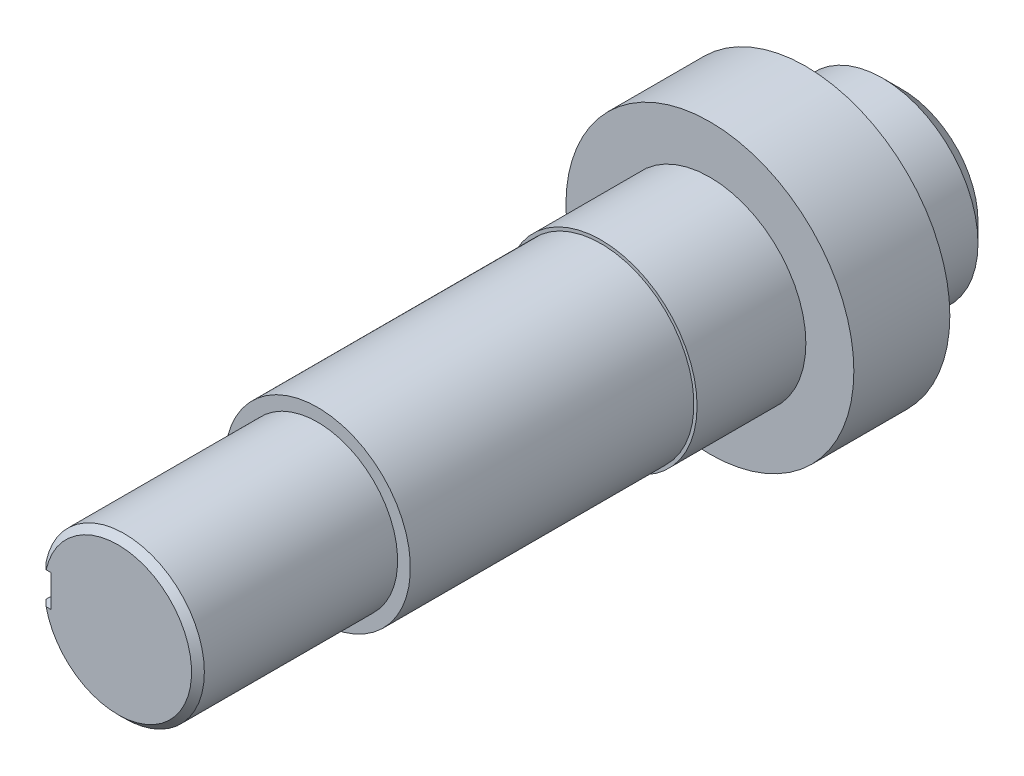
ISO-10303-21;
HEADER;
FILE_DESCRIPTION(('STEP AP214'),'2;1');
FILE_NAME('part.step','',(''),(''),'','','');
FILE_SCHEMA(('AUTOMOTIVE_DESIGN { 1 0 10303 214 1 1 1 1 }'));
ENDSEC;
DATA;
#1=APPLICATION_CONTEXT('core data for automotive mechanical design processes');
#2=APPLICATION_PROTOCOL_DEFINITION('international standard','automotive_design',2000,#1);
#3=PRODUCT_CONTEXT('',#1,'mechanical');
#4=PRODUCT('Part','Part','',(#3));
#5=PRODUCT_RELATED_PRODUCT_CATEGORY('part','',(#4));
#6=PRODUCT_DEFINITION_FORMATION('','',#4);
#7=PRODUCT_DEFINITION_CONTEXT('part definition',#1,'design');
#8=PRODUCT_DEFINITION('design','',#6,#7);
#9=PRODUCT_DEFINITION_SHAPE('','',#8);
#10=(LENGTH_UNIT() NAMED_UNIT(*) SI_UNIT(.MILLI.,.METRE.));
#11=(NAMED_UNIT(*) PLANE_ANGLE_UNIT() SI_UNIT($,.RADIAN.));
#12=(NAMED_UNIT(*) SI_UNIT($,.STERADIAN.) SOLID_ANGLE_UNIT());
#13=UNCERTAINTY_MEASURE_WITH_UNIT(LENGTH_MEASURE(1.E-05),#10,'distance_accuracy_value','');
#14=(GEOMETRIC_REPRESENTATION_CONTEXT(3) GLOBAL_UNCERTAINTY_ASSIGNED_CONTEXT((#13)) GLOBAL_UNIT_ASSIGNED_CONTEXT((#10,
#11,#12)) REPRESENTATION_CONTEXT('',''));
#15=CARTESIAN_POINT('',(0.,0.,0.));
#16=DIRECTION('',(0.,0.,1.));
#17=DIRECTION('',(1.,0.,0.));
#18=AXIS2_PLACEMENT_3D('',#15,#16,#17);
#19=CARTESIAN_POINT('',(0.,0.,-7.49999999999999));
#20=DIRECTION('',(0.,0.,-1.));
#21=DIRECTION('',(-1.,0.,0.));
#22=AXIS2_PLACEMENT_3D('',#19,#20,#21);
#23=CYLINDRICAL_SURFACE('',#22,12.5);
#24=CARTESIAN_POINT('',(0.,0.,83.8));
#25=DIRECTION('',(0.,0.,-1.));
#26=DIRECTION('',(-1.,0.,0.));
#27=AXIS2_PLACEMENT_3D('',#24,#25,#26);
#28=CIRCLE('',#27,12.5);
#29=CARTESIAN_POINT('',(-12.5,0.,83.8));
#30=VERTEX_POINT('',#29);
#31=EDGE_CURVE('E133',#30,#30,#28,.T.);
#32=ORIENTED_EDGE('',*,*,#31,.F.);
#33=EDGE_LOOP('',(#32));
#34=FACE_BOUND('',#33,.T.);
#35=DIRECTION('',(0.,0.,-1.));
#36=VECTOR('',#35,1.);
#37=CARTESIAN_POINT('',(-12.2474487139159,2.5,-7.49999999999999));
#38=LINE('',#37,#36);
#39=CARTESIAN_POINT('',(-12.2474487139159,2.49999999999997,114.));
#40=VERTEX_POINT('',#39);
#41=CARTESIAN_POINT('',(-12.2474487139159,2.49999999999997,102.));
#42=VERTEX_POINT('',#41);
#43=EDGE_CURVE('E100',#40,#42,#38,.T.);
#44=ORIENTED_EDGE('',*,*,#43,.F.);
#45=CARTESIAN_POINT('',(0.,0.,114.));
#46=DIRECTION('',(0.,0.,-1.));
#47=DIRECTION('',(-1.,0.,0.));
#48=AXIS2_PLACEMENT_3D('',#45,#46,#47);
#49=CIRCLE('',#48,12.5);
#50=CARTESIAN_POINT('',(-12.2474487139159,-2.50000000000003,114.));
#51=VERTEX_POINT('',#50);
#52=EDGE_CURVE('E190',#40,#51,#49,.T.);
#53=ORIENTED_EDGE('',*,*,#52,.T.);
#54=DIRECTION('',(0.,0.,-1.));
#55=VECTOR('',#54,1.);
#56=CARTESIAN_POINT('',(-12.2474487139159,-2.5,-7.49999999999999));
#57=LINE('',#56,#55);
#58=CARTESIAN_POINT('',(-12.2474487139159,-2.50000000000003,102.));
#59=VERTEX_POINT('',#58);
#60=EDGE_CURVE('E105',#59,#51,#57,.F.);
#61=ORIENTED_EDGE('',*,*,#60,.F.);
#62=CARTESIAN_POINT('',(-12.2474487139159,2.49999999999997,102.));
#63=CARTESIAN_POINT('',(-12.2474426870481,2.50000755272739,101.930435992851));
#64=CARTESIAN_POINT('',(-12.2480412546813,2.49709659553058,101.860876158115));
#65=CARTESIAN_POINT('',(-12.2504029528616,2.48549624534852,101.722268250026));
#66=CARTESIAN_POINT('',(-12.2521659393457,2.47680756718741,101.653220114433));
#67=CARTESIAN_POINT('',(-12.25680833904,2.45372788482213,101.516225753348));
#68=CARTESIAN_POINT('',(-12.259686051341,2.43934556755121,101.448278012586));
#69=CARTESIAN_POINT('',(-12.2664685140532,2.40500601307053,101.313877989414));
#70=CARTESIAN_POINT('',(-12.2703732686573,2.38504875310236,101.247425713109));
#71=CARTESIAN_POINT('',(-12.2834692504436,2.31701273293405,101.050995245321));
#72=CARTESIAN_POINT('',(-12.2940461363477,2.26075131705716,100.923834951703));
#73=CARTESIAN_POINT('',(-12.3176934066007,2.12812970933263,100.680810514378));
#74=CARTESIAN_POINT('',(-12.3307640493468,2.05176743436917,100.564947543155));
#75=CARTESIAN_POINT('',(-12.3581317705241,1.87995278838543,100.346107851703));
#76=CARTESIAN_POINT('',(-12.3724421926957,1.78427266064754,100.243311289598));
#77=CARTESIAN_POINT('',(-12.4005606698654,1.57702607132323,100.055111906301));
#78=CARTESIAN_POINT('',(-12.4143686467546,1.46545715284147,99.9697117801072));
#79=CARTESIAN_POINT('',(-12.4400702526805,1.22840024371406,99.8180282891781));
#80=CARTESIAN_POINT('',(-12.4519461799055,1.10279959145388,99.751917721986));
#81=CARTESIAN_POINT('',(-12.4722938885067,0.842002975760135,99.6418101436303));
#82=CARTESIAN_POINT('',(-12.4807661733763,0.706808435013447,99.5978098614993));
#83=CARTESIAN_POINT('',(-12.4932579438613,0.432543529973101,99.5337324169305));
#84=CARTESIAN_POINT('',(-12.4973345628875,0.293547588516944,99.5133480364947));
#85=CARTESIAN_POINT('',(-12.5007730438039,0.0140496897959572,99.4961225412004));
#86=CARTESIAN_POINT('',(-12.5001352506414,-0.126452156532632,99.4992797038381));
#87=CARTESIAN_POINT('',(-12.494260861056,-0.402855506346854,99.5288155036062));
#88=CARTESIAN_POINT('',(-12.4890899207821,-0.538794033247064,99.5548626254795));
#89=CARTESIAN_POINT('',(-12.4748043625545,-0.804330016531288,99.6289129417226));
#90=CARTESIAN_POINT('',(-12.4656896156329,-0.933927265392467,99.6769168541128));
#91=CARTESIAN_POINT('',(-12.4444322280103,-1.18405067824293,99.7938260089324));
#92=CARTESIAN_POINT('',(-12.4322708097766,-1.30451431703061,99.862861467367));
#93=CARTESIAN_POINT('',(-12.4062612907301,-1.53226609471826,100.01977567564));
#94=CARTESIAN_POINT('',(-12.3924130501763,-1.63955314055335,100.107655987095));
#95=CARTESIAN_POINT('',(-12.3642759342124,-1.83986551634356,100.301570904077));
#96=CARTESIAN_POINT('',(-12.3499835810434,-1.93261173748934,100.407893505183));
#97=CARTESIAN_POINT('',(-12.3227926529106,-2.09902724974942,100.634761896218));
#98=CARTESIAN_POINT('',(-12.3098944646352,-2.17269125605407,100.755311612915));
#99=CARTESIAN_POINT('',(-12.286943251058,-2.29894988661174,101.007631012366));
#100=CARTESIAN_POINT('',(-12.2768979874586,-2.35148719158621,101.139430058492));
#101=CARTESIAN_POINT('',(-12.2609040265623,-2.43351774332485,101.410146578139));
#102=CARTESIAN_POINT('',(-12.2549492282072,-2.46304531871088,101.54905311662));
#103=CARTESIAN_POINT('',(-12.2500794297991,-2.48708234530495,101.740892042116));
#104=CARTESIAN_POINT('',(-12.2490939967998,-2.4919281391388,101.792635349456));
#105=CARTESIAN_POINT('',(-12.2477791846693,-2.49838291166164,101.896244660344));
#106=CARTESIAN_POINT('',(-12.2474487076206,-2.49999730726165,101.94811031239));
#107=CARTESIAN_POINT('',(-12.2474487139159,-2.50000000000003,102.));
#108=B_SPLINE_CURVE_WITH_KNOTS('',3,(#62,#63,#64,#65,#66,#67,#68,#69,#70,#71,#72,#73,#74,#75,
#76,#77,#78,#79,#80,#81,#82,#83,#84,#85,#86,#87,#88,#89,#90,#91,#92,#93,#94,#95,#96,#97,#98,#99,
#100,#101,#102,#103,#104,#105,#106,#107),.UNSPECIFIED.,.F.,.F.,(4,2,2,2,2,2,2,2,2,2,2,2,2,2,2,2,
2,2,2,2,2,2,4),(0.,0.20862127589482,0.417216745803859,0.625495175237023,0.833774454931128,
1.25000691135226,1.66628252025788,2.08778731527758,2.50935735880449,2.93459542557451,
3.35977056463057,3.77935021287093,4.19889916132037,4.61247011057756,5.02605458519858,
5.44225366753898,5.85848725240718,6.28192795775074,6.70548580970532,7.13018519486868,
7.5542497439484,7.71010621722898,7.8657012030583),.UNSPECIFIED.);
#109=EDGE_CURVE('E181',#42,#59,#108,.T.);
#110=ORIENTED_EDGE('',*,*,#109,.F.);
#111=EDGE_LOOP('',(#44,#53,#61,#110));
#112=FACE_BOUND('',#111,.T.);
#113=ADVANCED_FACE('F42',(#34,#112),#23,.T.);
#114=CARTESIAN_POINT('',(0.,12.5,115.));
#115=DIRECTION('',(0.,0.,-1.));
#116=DIRECTION('',(-1.,0.,0.));
#117=AXIS2_PLACEMENT_3D('',#114,#115,#116);
#118=PLANE('',#117);
#119=DIRECTION('',(1.,0.,0.));
#120=VECTOR('',#119,1.);
#121=CARTESIAN_POINT('',(0.,-2.50000000000003,115.));
#122=LINE('',#121,#120);
#123=CARTESIAN_POINT('',(-11.2249721603218,-2.50000000000003,115.));
#124=VERTEX_POINT('',#123);
#125=CARTESIAN_POINT('',(-10.5,-2.50000000000003,115.));
#126=VERTEX_POINT('',#125);
#127=EDGE_CURVE('E175',#124,#126,#122,.T.);
#128=ORIENTED_EDGE('',*,*,#127,.F.);
#129=CARTESIAN_POINT('',(0.,0.,115.));
#130=DIRECTION('',(0.,0.,-1.));
#131=DIRECTION('',(-1.,0.,0.));
#132=AXIS2_PLACEMENT_3D('',#129,#130,#131);
#133=CIRCLE('',#132,11.5);
#134=CARTESIAN_POINT('',(-11.2249721603218,2.49999999999997,115.));
#135=VERTEX_POINT('',#134);
#136=EDGE_CURVE('E57',#124,#135,#133,.F.);
#137=ORIENTED_EDGE('',*,*,#136,.T.);
#138=DIRECTION('',(-1.,0.,0.));
#139=VECTOR('',#138,1.);
#140=CARTESIAN_POINT('',(0.,2.49999999999997,115.));
#141=LINE('',#140,#139);
#142=CARTESIAN_POINT('',(-10.5,2.49999999999997,115.));
#143=VERTEX_POINT('',#142);
#144=EDGE_CURVE('E178',#143,#135,#141,.T.);
#145=ORIENTED_EDGE('',*,*,#144,.F.);
#146=DIRECTION('',(0.,1.,0.));
#147=VECTOR('',#146,1.);
#148=CARTESIAN_POINT('',(-10.5,12.5,115.));
#149=LINE('',#148,#147);
#150=EDGE_CURVE('E115',#126,#143,#149,.T.);
#151=ORIENTED_EDGE('',*,*,#150,.F.);
#152=EDGE_LOOP('',(#128,#137,#145,#151));
#153=FACE_BOUND('',#152,.T.);
#154=ADVANCED_FACE('F204',(#153),#118,.F.);
#155=CARTESIAN_POINT('',(0.,0.,-7.49999999999999));
#156=DIRECTION('',(0.,0.,1.));
#157=DIRECTION('',(1.,0.,0.));
#158=AXIS2_PLACEMENT_3D('',#155,#156,#157);
#159=PLANE('',#158);
#160=CARTESIAN_POINT('',(0.,0.,-7.49999999999999));
#161=DIRECTION('',(0.,0.,1.));
#162=DIRECTION('',(1.,0.,0.));
#163=AXIS2_PLACEMENT_3D('',#160,#161,#162);
#164=CIRCLE('',#163,11.9);
#165=CARTESIAN_POINT('',(11.9,0.,-7.49999999999999));
#166=VERTEX_POINT('',#165);
#167=EDGE_CURVE('E165',#166,#166,#164,.F.);
#168=ORIENTED_EDGE('',*,*,#167,.T.);
#169=EDGE_LOOP('',(#168));
#170=FACE_BOUND('',#169,.T.);
#171=ADVANCED_FACE('F206',(#170),#159,.F.);
#172=CARTESIAN_POINT('',(0.,0.,-7.49999999999999));
#173=DIRECTION('',(0.,0.,-1.));
#174=DIRECTION('',(-1.,0.,0.));
#175=AXIS2_PLACEMENT_3D('',#172,#173,#174);
#176=CYLINDRICAL_SURFACE('',#175,14.9);
#177=CARTESIAN_POINT('',(0.,0.,-4.49999999999996));
#178=DIRECTION('',(0.,0.,1.));
#179=DIRECTION('',(1.,0.,0.));
#180=AXIS2_PLACEMENT_3D('',#177,#178,#179);
#181=CIRCLE('',#180,14.9);
#182=CARTESIAN_POINT('',(14.9,0.,-4.49999999999996));
#183=VERTEX_POINT('',#182);
#184=EDGE_CURVE('E169',#183,#183,#181,.T.);
#185=ORIENTED_EDGE('',*,*,#184,.T.);
#186=EDGE_LOOP('',(#185));
#187=FACE_BOUND('',#186,.T.);
#188=CARTESIAN_POINT('',(0.,0.,7.50000000000001));
#189=DIRECTION('',(0.,0.,-1.));
#190=DIRECTION('',(-1.,0.,0.));
#191=AXIS2_PLACEMENT_3D('',#188,#189,#190);
#192=CIRCLE('',#191,14.9);
#193=CARTESIAN_POINT('',(-14.9,0.,7.50000000000001));
#194=VERTEX_POINT('',#193);
#195=EDGE_CURVE('E161',#194,#194,#192,.T.);
#196=ORIENTED_EDGE('',*,*,#195,.T.);
#197=EDGE_LOOP('',(#196));
#198=FACE_BOUND('',#197,.T.);
#199=ADVANCED_FACE('F211',(#187,#198),#176,.T.);
#200=CARTESIAN_POINT('',(0.,14.9,7.50000000000001));
#201=DIRECTION('',(0.,0.,1.));
#202=DIRECTION('',(1.,0.,0.));
#203=AXIS2_PLACEMENT_3D('',#200,#201,#202);
#204=PLANE('',#203);
#205=ORIENTED_EDGE('',*,*,#195,.F.);
#206=EDGE_LOOP('',(#205));
#207=FACE_BOUND('',#206,.T.);
#208=CARTESIAN_POINT('',(0.,0.,7.50000000000001));
#209=DIRECTION('',(0.,0.,-1.));
#210=DIRECTION('',(-1.,0.,0.));
#211=AXIS2_PLACEMENT_3D('',#208,#209,#210);
#212=CIRCLE('',#211,22.5);
#213=CARTESIAN_POINT('',(-22.5,0.,7.50000000000001));
#214=VERTEX_POINT('',#213);
#215=EDGE_CURVE('E157',#214,#214,#212,.T.);
#216=ORIENTED_EDGE('',*,*,#215,.T.);
#217=EDGE_LOOP('',(#216));
#218=FACE_BOUND('',#217,.T.);
#219=ADVANCED_FACE('F338',(#207,#218),#204,.F.);
#220=CARTESIAN_POINT('',(0.,0.,-7.49999999999999));
#221=DIRECTION('',(0.,0.,-1.));
#222=DIRECTION('',(-1.,0.,0.));
#223=AXIS2_PLACEMENT_3D('',#220,#221,#222);
#224=CYLINDRICAL_SURFACE('',#223,22.5);
#225=ORIENTED_EDGE('',*,*,#215,.F.);
#226=EDGE_LOOP('',(#225));
#227=FACE_BOUND('',#226,.T.);
#228=CARTESIAN_POINT('',(0.,0.,22.5));
#229=DIRECTION('',(0.,0.,-1.));
#230=DIRECTION('',(-1.,0.,0.));
#231=AXIS2_PLACEMENT_3D('',#228,#229,#230);
#232=CIRCLE('',#231,22.5);
#233=CARTESIAN_POINT('',(-22.5,0.,22.5));
#234=VERTEX_POINT('',#233);
#235=EDGE_CURVE('E153',#234,#234,#232,.T.);
#236=ORIENTED_EDGE('',*,*,#235,.T.);
#237=EDGE_LOOP('',(#236));
#238=FACE_BOUND('',#237,.T.);
#239=ADVANCED_FACE('F327',(#227,#238),#224,.T.);
#240=CARTESIAN_POINT('',(0.,22.5,22.5));
#241=DIRECTION('',(0.,0.,-1.));
#242=DIRECTION('',(-1.,0.,0.));
#243=AXIS2_PLACEMENT_3D('',#240,#241,#242);
#244=PLANE('',#243);
#245=ORIENTED_EDGE('',*,*,#235,.F.);
#246=EDGE_LOOP('',(#245));
#247=FACE_BOUND('',#246,.T.);
#248=CARTESIAN_POINT('',(0.,0.,22.5));
#249=DIRECTION('',(0.,0.,-1.));
#250=DIRECTION('',(-1.,0.,0.));
#251=AXIS2_PLACEMENT_3D('',#248,#249,#250);
#252=CIRCLE('',#251,15.);
#253=CARTESIAN_POINT('',(-15.,0.,22.5));
#254=VERTEX_POINT('',#253);
#255=EDGE_CURVE('E149',#254,#254,#252,.T.);
#256=ORIENTED_EDGE('',*,*,#255,.T.);
#257=EDGE_LOOP('',(#256));
#258=FACE_BOUND('',#257,.T.);
#259=ADVANCED_FACE('F316',(#247,#258),#244,.F.);
#260=CARTESIAN_POINT('',(0.,0.,-7.49999999999999));
#261=DIRECTION('',(0.,0.,-1.));
#262=DIRECTION('',(-1.,0.,0.));
#263=AXIS2_PLACEMENT_3D('',#260,#261,#262);
#264=CYLINDRICAL_SURFACE('',#263,15.);
#265=ORIENTED_EDGE('',*,*,#255,.F.);
#266=EDGE_LOOP('',(#265));
#267=FACE_BOUND('',#266,.T.);
#268=CARTESIAN_POINT('',(0.,0.,39.5));
#269=DIRECTION('',(0.,0.,-1.));
#270=DIRECTION('',(-1.,0.,0.));
#271=AXIS2_PLACEMENT_3D('',#268,#269,#270);
#272=CIRCLE('',#271,15.);
#273=CARTESIAN_POINT('',(-15.,0.,39.5));
#274=VERTEX_POINT('',#273);
#275=EDGE_CURVE('E145',#274,#274,#272,.T.);
#276=ORIENTED_EDGE('',*,*,#275,.T.);
#277=EDGE_LOOP('',(#276));
#278=FACE_BOUND('',#277,.T.);
#279=ADVANCED_FACE('F305',(#267,#278),#264,.T.);
#280=CARTESIAN_POINT('',(0.,15.,39.5));
#281=DIRECTION('',(0.,0.,-1.));
#282=DIRECTION('',(-1.,0.,0.));
#283=AXIS2_PLACEMENT_3D('',#280,#281,#282);
#284=PLANE('',#283);
#285=ORIENTED_EDGE('',*,*,#275,.F.);
#286=EDGE_LOOP('',(#285));
#287=FACE_BOUND('',#286,.T.);
#288=CARTESIAN_POINT('',(0.,0.,39.5));
#289=DIRECTION('',(0.,0.,-1.));
#290=DIRECTION('',(-1.,0.,0.));
#291=AXIS2_PLACEMENT_3D('',#288,#289,#290);
#292=CIRCLE('',#291,14.5);
#293=CARTESIAN_POINT('',(-14.5,0.,39.5));
#294=VERTEX_POINT('',#293);
#295=EDGE_CURVE('E141',#294,#294,#292,.T.);
#296=ORIENTED_EDGE('',*,*,#295,.T.);
#297=EDGE_LOOP('',(#296));
#298=FACE_BOUND('',#297,.T.);
#299=ADVANCED_FACE('F294',(#287,#298),#284,.F.);
#300=CARTESIAN_POINT('',(0.,0.,-7.49999999999999));
#301=DIRECTION('',(0.,0.,-1.));
#302=DIRECTION('',(-1.,0.,0.));
#303=AXIS2_PLACEMENT_3D('',#300,#301,#302);
#304=CYLINDRICAL_SURFACE('',#303,14.5);
#305=ORIENTED_EDGE('',*,*,#295,.F.);
#306=EDGE_LOOP('',(#305));
#307=FACE_BOUND('',#306,.T.);
#308=CARTESIAN_POINT('',(0.,0.,83.8));
#309=DIRECTION('',(0.,0.,-1.));
#310=DIRECTION('',(-1.,0.,0.));
#311=AXIS2_PLACEMENT_3D('',#308,#309,#310);
#312=CIRCLE('',#311,14.5);
#313=CARTESIAN_POINT('',(-14.5,0.,83.8));
#314=VERTEX_POINT('',#313);
#315=EDGE_CURVE('E137',#314,#314,#312,.T.);
#316=ORIENTED_EDGE('',*,*,#315,.T.);
#317=EDGE_LOOP('',(#316));
#318=FACE_BOUND('',#317,.T.);
#319=ADVANCED_FACE('F284',(#307,#318),#304,.T.);
#320=CARTESIAN_POINT('',(0.,14.5,83.8));
#321=DIRECTION('',(0.,0.,-1.));
#322=DIRECTION('',(-1.,0.,0.));
#323=AXIS2_PLACEMENT_3D('',#320,#321,#322);
#324=PLANE('',#323);
#325=ORIENTED_EDGE('',*,*,#315,.F.);
#326=EDGE_LOOP('',(#325));
#327=FACE_BOUND('',#326,.T.);
#328=ORIENTED_EDGE('',*,*,#31,.T.);
#329=EDGE_LOOP('',(#328));
#330=FACE_BOUND('',#329,.T.);
#331=ADVANCED_FACE('F274',(#327,#330),#324,.F.);
#332=CARTESIAN_POINT('',(0.,0.,-7.49999999999999));
#333=DIRECTION('',(0.,0.,1.));
#334=DIRECTION('',(1.,0.,0.));
#335=AXIS2_PLACEMENT_3D('',#332,#333,#334);
#336=CONICAL_SURFACE('',#335,11.9,0.785398163397447);
#337=ORIENTED_EDGE('',*,*,#184,.F.);
#338=EDGE_LOOP('',(#337));
#339=FACE_BOUND('',#338,.T.);
#340=ORIENTED_EDGE('',*,*,#167,.F.);
#341=EDGE_LOOP('',(#340));
#342=FACE_BOUND('',#341,.T.);
#343=ADVANCED_FACE('F198',(#339,#342),#336,.T.);
#344=CARTESIAN_POINT('',(-22.5,0.,102.));
#345=DIRECTION('',(1.,0.,0.));
#346=DIRECTION('',(0.,0.,-1.));
#347=AXIS2_PLACEMENT_3D('',#344,#345,#346);
#348=CYLINDRICAL_SURFACE('',#347,2.5);
#349=ORIENTED_EDGE('',*,*,#109,.T.);
#350=DIRECTION('',(1.,0.,0.));
#351=VECTOR('',#350,1.);
#352=CARTESIAN_POINT('',(-22.5,-2.50000000000002,102.));
#353=LINE('',#352,#351);
#354=CARTESIAN_POINT('',(-10.5,-2.50000000000003,102.));
#355=VERTEX_POINT('',#354);
#356=EDGE_CURVE('E106',#59,#355,#353,.T.);
#357=ORIENTED_EDGE('',*,*,#356,.T.);
#358=CARTESIAN_POINT('',(-10.5,0.,102.));
#359=DIRECTION('',(-1.,0.,0.));
#360=DIRECTION('',(0.,0.,1.));
#361=AXIS2_PLACEMENT_3D('',#358,#359,#360);
#362=CIRCLE('',#361,2.5);
#363=CARTESIAN_POINT('',(-10.5,2.49999999999997,102.));
#364=VERTEX_POINT('',#363);
#365=EDGE_CURVE('E112',#364,#355,#362,.T.);
#366=ORIENTED_EDGE('',*,*,#365,.F.);
#367=DIRECTION('',(1.,0.,0.));
#368=VECTOR('',#367,1.);
#369=CARTESIAN_POINT('',(-22.5,2.49999999999999,102.));
#370=LINE('',#369,#368);
#371=EDGE_CURVE('E95',#42,#364,#370,.T.);
#372=ORIENTED_EDGE('',*,*,#371,.F.);
#373=EDGE_LOOP('',(#349,#357,#366,#372));
#374=FACE_BOUND('',#373,.T.);
#375=ADVANCED_FACE('F118',(#374),#348,.F.);
#376=CARTESIAN_POINT('',(-22.5,2.49999999999999,128.));
#377=DIRECTION('',(0.,-1.,0.));
#378=DIRECTION('',(1.,0.,0.));
#379=AXIS2_PLACEMENT_3D('',#376,#377,#378);
#380=PLANE('',#379);
#381=ORIENTED_EDGE('',*,*,#144,.T.);
#382=CARTESIAN_POINT('',(-11.2249721603218,2.49999999999997,115.));
#383=CARTESIAN_POINT('',(-11.3955427232605,2.49999999999998,114.833494681046));
#384=CARTESIAN_POINT('',(-11.5660343849909,2.49999999999999,114.666908687457));
#385=CARTESIAN_POINT('',(-11.9068599028527,2.49999999999999,114.333575354121));
#386=CARTESIAN_POINT('',(-12.0771937589869,2.49999999999998,114.166828014377));
#387=CARTESIAN_POINT('',(-12.2474487139159,2.49999999999997,114.));
#388=B_SPLINE_CURVE_WITH_KNOTS('',3,(#382,#383,#384,#385,#386,#387),.UNSPECIFIED.,.F.,.F.,(4,2,
4),(0.,0.715097685506868,1.4301953576579),.UNSPECIFIED.);
#389=EDGE_CURVE('E11',#135,#40,#388,.T.);
#390=ORIENTED_EDGE('',*,*,#389,.T.);
#391=ORIENTED_EDGE('',*,*,#43,.T.);
#392=ORIENTED_EDGE('',*,*,#371,.T.);
#393=DIRECTION('',(0.,0.,-1.));
#394=VECTOR('',#393,1.);
#395=CARTESIAN_POINT('',(-10.5,2.49999999999997,128.));
#396=LINE('',#395,#394);
#397=EDGE_CURVE('E98',#143,#364,#396,.T.);
#398=ORIENTED_EDGE('',*,*,#397,.F.);
#399=EDGE_LOOP('',(#381,#390,#391,#392,#398));
#400=FACE_BOUND('',#399,.T.);
#401=ADVANCED_FACE('F97',(#400),#380,.T.);
#402=CARTESIAN_POINT('',(-22.5,-2.50000000000002,128.));
#403=DIRECTION('',(0.,1.,0.));
#404=DIRECTION('',(-1.,0.,0.));
#405=AXIS2_PLACEMENT_3D('',#402,#403,#404);
#406=PLANE('',#405);
#407=ORIENTED_EDGE('',*,*,#60,.T.);
#408=CARTESIAN_POINT('',(-12.2474487139159,-2.50000000000003,114.));
#409=CARTESIAN_POINT('',(-12.0771937589869,-2.50000000000002,114.166828014377));
#410=CARTESIAN_POINT('',(-11.9068599028527,-2.50000000000002,114.333575354121));
#411=CARTESIAN_POINT('',(-11.5660343849909,-2.50000000000002,114.666908687457));
#412=CARTESIAN_POINT('',(-11.3955427232605,-2.50000000000002,114.833494681046));
#413=CARTESIAN_POINT('',(-11.2249721603218,-2.50000000000003,115.));
#414=B_SPLINE_CURVE_WITH_KNOTS('',3,(#408,#409,#410,#411,#412,#413),.UNSPECIFIED.,.F.,.F.,(4,2,
4),(0.,0.715097672151037,1.4301953576579),.UNSPECIFIED.);
#415=EDGE_CURVE('E71',#51,#124,#414,.T.);
#416=ORIENTED_EDGE('',*,*,#415,.T.);
#417=ORIENTED_EDGE('',*,*,#127,.T.);
#418=DIRECTION('',(0.,0.,1.));
#419=VECTOR('',#418,1.);
#420=CARTESIAN_POINT('',(-10.5,-2.50000000000003,128.));
#421=LINE('',#420,#419);
#422=EDGE_CURVE('E121',#355,#126,#421,.T.);
#423=ORIENTED_EDGE('',*,*,#422,.F.);
#424=ORIENTED_EDGE('',*,*,#356,.F.);
#425=EDGE_LOOP('',(#407,#416,#417,#423,#424));
#426=FACE_BOUND('',#425,.T.);
#427=ADVANCED_FACE('F199',(#426),#406,.T.);
#428=CARTESIAN_POINT('',(-10.5,0.,128.));
#429=DIRECTION('',(-1.,0.,0.));
#430=DIRECTION('',(0.,0.,1.));
#431=AXIS2_PLACEMENT_3D('',#428,#429,#430);
#432=PLANE('',#431);
#433=ORIENTED_EDGE('',*,*,#150,.T.);
#434=ORIENTED_EDGE('',*,*,#397,.T.);
#435=ORIENTED_EDGE('',*,*,#365,.T.);
#436=ORIENTED_EDGE('',*,*,#422,.T.);
#437=EDGE_LOOP('',(#433,#434,#435,#436));
#438=FACE_BOUND('',#437,.T.);
#439=ADVANCED_FACE('F110',(#438),#432,.T.);
#440=CARTESIAN_POINT('',(0.,0.,114.));
#441=DIRECTION('',(0.,0.,-1.));
#442=DIRECTION('',(-1.,0.,0.));
#443=AXIS2_PLACEMENT_3D('',#440,#441,#442);
#444=CONICAL_SURFACE('',#443,12.5,0.785398163397454);
#445=ORIENTED_EDGE('',*,*,#389,.F.);
#446=ORIENTED_EDGE('',*,*,#136,.F.);
#447=ORIENTED_EDGE('',*,*,#415,.F.);
#448=ORIENTED_EDGE('',*,*,#52,.F.);
#449=EDGE_LOOP('',(#445,#446,#447,#448));
#450=FACE_BOUND('',#449,.T.);
#451=ADVANCED_FACE('F44',(#450),#444,.T.);
#452=CLOSED_SHELL('',(#113,#154,#171,#199,#219,#239,#259,#279,#299,#319,#331,#343,#375,#401,
#427,#439,#451));
#453=MANIFOLD_SOLID_BREP('B2',#452);
#454=ADVANCED_BREP_SHAPE_REPRESENTATION('',(#18,#453),#14);
#455=SHAPE_DEFINITION_REPRESENTATION(#9,#454);
ENDSEC;
END-ISO-10303-21;
